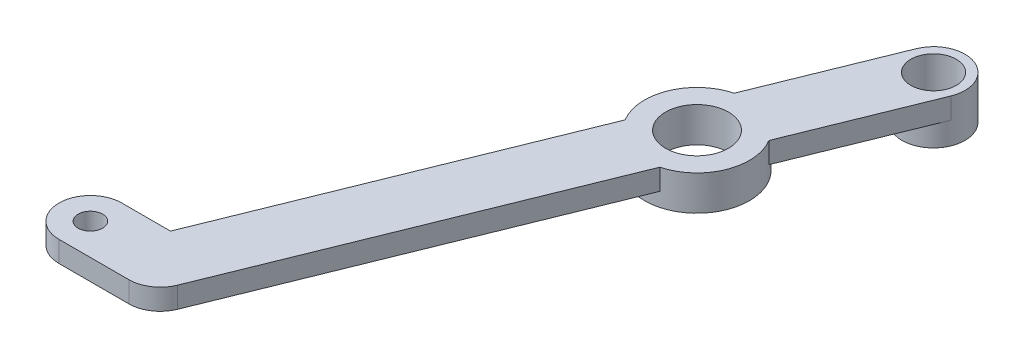
ISO-10303-21;
HEADER;
FILE_DESCRIPTION(('STEP AP214'),'2;1');
FILE_NAME('part.step','',(''),(''),'','','');
FILE_SCHEMA(('AUTOMOTIVE_DESIGN { 1 0 10303 214 1 1 1 1 }'));
ENDSEC;
DATA;
#1=APPLICATION_CONTEXT('core data for automotive mechanical design processes');
#2=APPLICATION_PROTOCOL_DEFINITION('international standard','automotive_design',2000,#1);
#3=PRODUCT_CONTEXT('',#1,'mechanical');
#4=PRODUCT('Part','Part','',(#3));
#5=PRODUCT_RELATED_PRODUCT_CATEGORY('part','',(#4));
#6=PRODUCT_DEFINITION_FORMATION('','',#4);
#7=PRODUCT_DEFINITION_CONTEXT('part definition',#1,'design');
#8=PRODUCT_DEFINITION('design','',#6,#7);
#9=PRODUCT_DEFINITION_SHAPE('','',#8);
#10=(LENGTH_UNIT() NAMED_UNIT(*) SI_UNIT(.MILLI.,.METRE.));
#11=(NAMED_UNIT(*) PLANE_ANGLE_UNIT() SI_UNIT($,.RADIAN.));
#12=(NAMED_UNIT(*) SI_UNIT($,.STERADIAN.) SOLID_ANGLE_UNIT());
#13=UNCERTAINTY_MEASURE_WITH_UNIT(LENGTH_MEASURE(1.E-05),#10,'distance_accuracy_value','');
#14=(GEOMETRIC_REPRESENTATION_CONTEXT(3) GLOBAL_UNCERTAINTY_ASSIGNED_CONTEXT((#13)) GLOBAL_UNIT_ASSIGNED_CONTEXT((#10,
#11,#12)) REPRESENTATION_CONTEXT('',''));
#15=CARTESIAN_POINT('',(0.,0.,0.));
#16=DIRECTION('',(0.,0.,1.));
#17=DIRECTION('',(1.,0.,0.));
#18=AXIS2_PLACEMENT_3D('',#15,#16,#17);
#19=CARTESIAN_POINT('',(0.,0.,0.));
#20=DIRECTION('',(0.,1.,0.));
#21=DIRECTION('',(0.,0.,1.));
#22=AXIS2_PLACEMENT_3D('',#19,#20,#21);
#23=PLANE('',#22);
#24=CARTESIAN_POINT('',(32.1376615678532,0.,-54.6893402804166));
#25=DIRECTION('',(0.,1.,0.));
#26=DIRECTION('',(0.,0.,1.));
#27=AXIS2_PLACEMENT_3D('',#24,#25,#26);
#28=CIRCLE('',#27,7.5);
#29=CARTESIAN_POINT('',(30.2177283160776,0.,-61.9394338183461));
#30=VERTEX_POINT('',#29);
#31=CARTESIAN_POINT('',(38.5601700537683,0.,-58.5625023927414));
#32=VERTEX_POINT('',#31);
#33=EDGE_CURVE('E240',#30,#32,#28,.F.);
#34=ORIENTED_EDGE('',*,*,#33,.F.);
#35=DIRECTION('',(-0.375214602844968,0.,0.926937970854519));
#36=VECTOR('',#35,1.);
#37=CARTESIAN_POINT('',(4.42091914927362,0.,1.78954091315865));
#38=LINE('',#37,#36);
#39=CARTESIAN_POINT('',(37.722020372977,0.,-80.4781932354364));
#40=VERTEX_POINT('',#39);
#41=EDGE_CURVE('E212',#40,#30,#38,.T.);
#42=ORIENTED_EDGE('',*,*,#41,.F.);
#43=CARTESIAN_POINT('',(41.8932412418223,0.,-78.7897275226341));
#44=DIRECTION('',(0.,1.,0.));
#45=DIRECTION('',(0.,0.,1.));
#46=AXIS2_PLACEMENT_3D('',#43,#44,#45);
#47=CIRCLE('',#46,4.49999999999999);
#48=CARTESIAN_POINT('',(46.0644621106677,0.,-77.1012618098318));
#49=VERTEX_POINT('',#48);
#50=EDGE_CURVE('E217',#40,#49,#47,.T.);
#51=ORIENTED_EDGE('',*,*,#50,.T.);
#52=DIRECTION('',(0.375214602844968,0.,-0.926937970854519));
#53=VECTOR('',#52,1.);
#54=CARTESIAN_POINT('',(12.7633608869643,0.,5.16647233876335));
#55=LINE('',#54,#53);
#56=EDGE_CURVE('E215',#32,#49,#55,.T.);
#57=ORIENTED_EDGE('',*,*,#56,.F.);
#58=EDGE_LOOP('',(#34,#42,#51,#57));
#59=FACE_BOUND('',#58,.T.);
#60=ADVANCED_FACE('F35',(#59),#23,.F.);
#61=CARTESIAN_POINT('',(4.42091914927362,0.,1.78954091315865));
#62=DIRECTION('',(-0.926937970854519,0.,-0.375214602844968));
#63=DIRECTION('',(-0.375214602844968,0.,0.926937970854519));
#64=AXIS2_PLACEMENT_3D('',#61,#62,#63);
#65=PLANE('',#64);
#66=DIRECTION('',(-0.375214602844968,0.,0.926937970854519));
#67=VECTOR('',#66,1.);
#68=CARTESIAN_POINT('',(4.42091914927362,3.,1.78954091315865));
#69=LINE('',#68,#67);
#70=CARTESIAN_POINT('',(25.715153081938,3.,-50.8161781680919));
#71=VERTEX_POINT('',#70);
#72=CARTESIAN_POINT('',(6.96685821964362,3.,-4.5));
#73=VERTEX_POINT('',#72);
#74=EDGE_CURVE('E57',#71,#73,#69,.T.);
#75=ORIENTED_EDGE('',*,*,#74,.F.);
#76=DIRECTION('',(0.,1.,0.));
#77=VECTOR('',#76,1.);
#78=CARTESIAN_POINT('',(25.715153081938,-2.,-50.8161781680918));
#79=LINE('',#78,#77);
#80=CARTESIAN_POINT('',(25.715153081938,0.,-50.8161781680918));
#81=VERTEX_POINT('',#80);
#82=EDGE_CURVE('E211',#71,#81,#79,.F.);
#83=ORIENTED_EDGE('',*,*,#82,.T.);
#84=CARTESIAN_POINT('',(6.96685821964362,0.,-4.5));
#85=VERTEX_POINT('',#84);
#86=EDGE_CURVE('E144',#81,#85,#38,.T.);
#87=ORIENTED_EDGE('',*,*,#86,.T.);
#88=DIRECTION('',(0.,1.,0.));
#89=VECTOR('',#88,1.);
#90=CARTESIAN_POINT('',(6.96685821964361,0.,-4.5));
#91=LINE('',#90,#89);
#92=EDGE_CURVE('E158',#85,#73,#91,.T.);
#93=ORIENTED_EDGE('',*,*,#92,.T.);
#94=EDGE_LOOP('',(#75,#83,#87,#93));
#95=FACE_BOUND('',#94,.T.);
#96=ADVANCED_FACE('F208',(#95),#65,.T.);
#97=ORIENTED_EDGE('',*,*,#41,.T.);
#98=DIRECTION('',(0.,1.,0.));
#99=VECTOR('',#98,1.);
#100=CARTESIAN_POINT('',(30.2177283160776,-2.,-61.9394338183461));
#101=LINE('',#100,#99);
#102=CARTESIAN_POINT('',(30.2177283160776,3.,-61.9394338183461));
#103=VERTEX_POINT('',#102);
#104=EDGE_CURVE('E238',#30,#103,#101,.T.);
#105=ORIENTED_EDGE('',*,*,#104,.T.);
#106=CARTESIAN_POINT('',(37.722020372977,3.,-80.4781932354364));
#107=VERTEX_POINT('',#106);
#108=EDGE_CURVE('E146',#107,#103,#69,.T.);
#109=ORIENTED_EDGE('',*,*,#108,.F.);
#110=DIRECTION('',(0.,1.,0.));
#111=VECTOR('',#110,1.);
#112=CARTESIAN_POINT('',(37.722020372977,0.,-80.4781932354364));
#113=LINE('',#112,#111);
#114=EDGE_CURVE('E150',#40,#107,#113,.T.);
#115=ORIENTED_EDGE('',*,*,#114,.F.);
#116=EDGE_LOOP('',(#97,#105,#109,#115));
#117=FACE_BOUND('',#116,.T.);
#118=ADVANCED_FACE('F237',(#117),#65,.T.);
#119=CARTESIAN_POINT('',(12.7633608869643,0.,5.16647233876335));
#120=DIRECTION('',(0.926937970854519,0.,0.375214602844969));
#121=DIRECTION('',(0.375214602844969,0.,-0.926937970854519));
#122=AXIS2_PLACEMENT_3D('',#119,#120,#121);
#123=PLANE('',#122);
#124=DIRECTION('',(0.375214602844968,0.,-0.926937970854519));
#125=VECTOR('',#124,1.);
#126=CARTESIAN_POINT('',(12.7633608869643,3.,5.16647233876335));
#127=LINE('',#126,#125);
#128=CARTESIAN_POINT('',(38.5601700537683,3.,-58.5625023927414));
#129=VERTEX_POINT('',#128);
#130=CARTESIAN_POINT('',(46.0644621106677,3.,-77.1012618098318));
#131=VERTEX_POINT('',#130);
#132=EDGE_CURVE('E141',#129,#131,#127,.T.);
#133=ORIENTED_EDGE('',*,*,#132,.F.);
#134=DIRECTION('',(0.,1.,0.));
#135=VECTOR('',#134,1.);
#136=CARTESIAN_POINT('',(38.5601700537683,-2.,-58.5625023927414));
#137=LINE('',#136,#135);
#138=EDGE_CURVE('E11',#129,#32,#137,.F.);
#139=ORIENTED_EDGE('',*,*,#138,.T.);
#140=ORIENTED_EDGE('',*,*,#56,.T.);
#141=DIRECTION('',(0.,1.,0.));
#142=VECTOR('',#141,1.);
#143=CARTESIAN_POINT('',(46.0644621106677,0.,-77.1012618098318));
#144=LINE('',#143,#142);
#145=EDGE_CURVE('E153',#49,#131,#144,.T.);
#146=ORIENTED_EDGE('',*,*,#145,.T.);
#147=EDGE_LOOP('',(#133,#139,#140,#146));
#148=FACE_BOUND('',#147,.T.);
#149=ADVANCED_FACE('F222',(#148),#123,.T.);
#150=CARTESIAN_POINT('',(14.1712208688453,0.,1.68846571280235));
#151=VERTEX_POINT('',#150);
#152=CARTESIAN_POINT('',(34.0575948196287,0.,-47.4392467424871));
#153=VERTEX_POINT('',#152);
#154=EDGE_CURVE('E132',#151,#153,#55,.T.);
#155=ORIENTED_EDGE('',*,*,#154,.T.);
#156=DIRECTION('',(0.,1.,0.));
#157=VECTOR('',#156,1.);
#158=CARTESIAN_POINT('',(34.0575948196287,-2.,-47.4392467424871));
#159=LINE('',#158,#157);
#160=CARTESIAN_POINT('',(34.0575948196287,3.,-47.4392467424871));
#161=VERTEX_POINT('',#160);
#162=EDGE_CURVE('E43',#153,#161,#159,.T.);
#163=ORIENTED_EDGE('',*,*,#162,.T.);
#164=CARTESIAN_POINT('',(14.1712208688453,3.,1.68846571280235));
#165=VERTEX_POINT('',#164);
#166=EDGE_CURVE('E130',#165,#161,#127,.T.);
#167=ORIENTED_EDGE('',*,*,#166,.F.);
#168=DIRECTION('',(0.,1.,0.));
#169=VECTOR('',#168,1.);
#170=CARTESIAN_POINT('',(14.1712208688453,0.,1.68846571280236));
#171=LINE('',#170,#169);
#172=EDGE_CURVE('E156',#151,#165,#171,.T.);
#173=ORIENTED_EDGE('',*,*,#172,.F.);
#174=EDGE_LOOP('',(#155,#163,#167,#173));
#175=FACE_BOUND('',#174,.T.);
#176=ADVANCED_FACE('F128',(#175),#123,.T.);
#177=CARTESIAN_POINT('',(0.,3.,0.));
#178=DIRECTION('',(0.,-1.,0.));
#179=DIRECTION('',(0.,0.,-1.));
#180=AXIS2_PLACEMENT_3D('',#177,#178,#179);
#181=CYLINDRICAL_SURFACE('',#180,4.5);
#182=CARTESIAN_POINT('',(0.,0.,0.));
#183=DIRECTION('',(0.,1.,0.));
#184=DIRECTION('',(0.,0.,1.));
#185=AXIS2_PLACEMENT_3D('',#182,#183,#184);
#186=CIRCLE('',#185,4.5);
#187=CARTESIAN_POINT('',(0.,0.,-4.5));
#188=VERTEX_POINT('',#187);
#189=CARTESIAN_POINT('',(0.,0.,4.5));
#190=VERTEX_POINT('',#189);
#191=EDGE_CURVE('E176',#188,#190,#186,.T.);
#192=ORIENTED_EDGE('',*,*,#191,.T.);
#193=DIRECTION('',(0.,-1.,0.));
#194=VECTOR('',#193,1.);
#195=CARTESIAN_POINT('',(0.,3.,4.5));
#196=LINE('',#195,#194);
#197=CARTESIAN_POINT('',(0.,3.,4.5));
#198=VERTEX_POINT('',#197);
#199=EDGE_CURVE('E133',#198,#190,#196,.T.);
#200=ORIENTED_EDGE('',*,*,#199,.F.);
#201=CARTESIAN_POINT('',(0.,3.,0.));
#202=DIRECTION('',(0.,1.,0.));
#203=DIRECTION('',(0.,0.,1.));
#204=AXIS2_PLACEMENT_3D('',#201,#202,#203);
#205=CIRCLE('',#204,4.5);
#206=CARTESIAN_POINT('',(0.,3.,-4.5));
#207=VERTEX_POINT('',#206);
#208=EDGE_CURVE('E164',#207,#198,#205,.T.);
#209=ORIENTED_EDGE('',*,*,#208,.F.);
#210=DIRECTION('',(0.,-1.,0.));
#211=VECTOR('',#210,1.);
#212=CARTESIAN_POINT('',(0.,3.,-4.5));
#213=LINE('',#212,#211);
#214=EDGE_CURVE('E173',#207,#188,#213,.T.);
#215=ORIENTED_EDGE('',*,*,#214,.T.);
#216=EDGE_LOOP('',(#192,#200,#209,#215));
#217=FACE_BOUND('',#216,.T.);
#218=ADVANCED_FACE('F196',(#217),#181,.T.);
#219=CARTESIAN_POINT('',(0.,3.,4.5));
#220=DIRECTION('',(0.,0.,1.));
#221=DIRECTION('',(1.,0.,0.));
#222=AXIS2_PLACEMENT_3D('',#219,#220,#221);
#223=PLANE('',#222);
#224=DIRECTION('',(-1.,0.,0.));
#225=VECTOR('',#224,1.);
#226=CARTESIAN_POINT('',(0.,0.,4.5));
#227=LINE('',#226,#225);
#228=CARTESIAN_POINT('',(10.,0.,4.5));
#229=VERTEX_POINT('',#228);
#230=EDGE_CURVE('E179',#229,#190,#227,.T.);
#231=ORIENTED_EDGE('',*,*,#230,.F.);
#232=DIRECTION('',(0.,-1.,0.));
#233=VECTOR('',#232,1.);
#234=CARTESIAN_POINT('',(10.,3.,4.5));
#235=LINE('',#234,#233);
#236=CARTESIAN_POINT('',(10.,3.,4.5));
#237=VERTEX_POINT('',#236);
#238=EDGE_CURVE('E187',#237,#229,#235,.T.);
#239=ORIENTED_EDGE('',*,*,#238,.F.);
#240=DIRECTION('',(-1.,0.,0.));
#241=VECTOR('',#240,1.);
#242=CARTESIAN_POINT('',(0.,3.,4.5));
#243=LINE('',#242,#241);
#244=EDGE_CURVE('E167',#237,#198,#243,.T.);
#245=ORIENTED_EDGE('',*,*,#244,.T.);
#246=ORIENTED_EDGE('',*,*,#199,.T.);
#247=EDGE_LOOP('',(#231,#239,#245,#246));
#248=FACE_BOUND('',#247,.T.);
#249=ADVANCED_FACE('F192',(#248),#223,.T.);
#250=CARTESIAN_POINT('',(10.,3.,0.));
#251=DIRECTION('',(0.,-1.,0.));
#252=DIRECTION('',(0.,0.,-1.));
#253=AXIS2_PLACEMENT_3D('',#250,#251,#252);
#254=CYLINDRICAL_SURFACE('',#253,4.50000000000001);
#255=CARTESIAN_POINT('',(10.,0.,0.));
#256=DIRECTION('',(0.,1.,0.));
#257=DIRECTION('',(0.,0.,1.));
#258=AXIS2_PLACEMENT_3D('',#255,#256,#257);
#259=CIRCLE('',#258,4.50000000000001);
#260=EDGE_CURVE('E182',#229,#151,#259,.T.);
#261=ORIENTED_EDGE('',*,*,#260,.T.);
#262=ORIENTED_EDGE('',*,*,#172,.T.);
#263=CARTESIAN_POINT('',(10.,3.,0.));
#264=DIRECTION('',(0.,1.,0.));
#265=DIRECTION('',(0.,0.,1.));
#266=AXIS2_PLACEMENT_3D('',#263,#264,#265);
#267=CIRCLE('',#266,4.50000000000001);
#268=EDGE_CURVE('E139',#237,#165,#267,.T.);
#269=ORIENTED_EDGE('',*,*,#268,.F.);
#270=ORIENTED_EDGE('',*,*,#238,.T.);
#271=EDGE_LOOP('',(#261,#262,#269,#270));
#272=FACE_BOUND('',#271,.T.);
#273=ADVANCED_FACE('F203',(#272),#254,.T.);
#274=CARTESIAN_POINT('',(0.,3.,0.));
#275=DIRECTION('',(0.,-1.,0.));
#276=DIRECTION('',(0.,0.,-1.));
#277=AXIS2_PLACEMENT_3D('',#274,#275,#276);
#278=CYLINDRICAL_SURFACE('',#277,1.75);
#279=CARTESIAN_POINT('',(0.,3.,0.));
#280=DIRECTION('',(0.,1.,0.));
#281=DIRECTION('',(0.,0.,1.));
#282=AXIS2_PLACEMENT_3D('',#279,#280,#281);
#283=CIRCLE('',#282,1.75);
#284=CARTESIAN_POINT('',(0.,3.,1.75));
#285=VERTEX_POINT('',#284);
#286=EDGE_CURVE('E161',#285,#285,#283,.T.);
#287=ORIENTED_EDGE('',*,*,#286,.T.);
#288=EDGE_LOOP('',(#287));
#289=FACE_BOUND('',#288,.T.);
#290=CARTESIAN_POINT('',(0.,0.,0.));
#291=DIRECTION('',(0.,1.,0.));
#292=DIRECTION('',(0.,0.,1.));
#293=AXIS2_PLACEMENT_3D('',#290,#291,#292);
#294=CIRCLE('',#293,1.75);
#295=CARTESIAN_POINT('',(0.,0.,1.75));
#296=VERTEX_POINT('',#295);
#297=EDGE_CURVE('E152',#296,#296,#294,.T.);
#298=ORIENTED_EDGE('',*,*,#297,.F.);
#299=EDGE_LOOP('',(#298));
#300=FACE_BOUND('',#299,.T.);
#301=ADVANCED_FACE('F37',(#289,#300),#278,.F.);
#302=CARTESIAN_POINT('',(0.,3.,-4.5));
#303=DIRECTION('',(0.,0.,-1.));
#304=DIRECTION('',(-1.,0.,0.));
#305=AXIS2_PLACEMENT_3D('',#302,#303,#304);
#306=PLANE('',#305);
#307=ORIENTED_EDGE('',*,*,#92,.F.);
#308=DIRECTION('',(1.,0.,0.));
#309=VECTOR('',#308,1.);
#310=CARTESIAN_POINT('',(0.,0.,-4.5));
#311=LINE('',#310,#309);
#312=EDGE_CURVE('E165',#188,#85,#311,.T.);
#313=ORIENTED_EDGE('',*,*,#312,.F.);
#314=ORIENTED_EDGE('',*,*,#214,.F.);
#315=DIRECTION('',(1.,0.,0.));
#316=VECTOR('',#315,1.);
#317=CARTESIAN_POINT('',(0.,3.,-4.5));
#318=LINE('',#317,#316);
#319=EDGE_CURVE('E171',#207,#73,#318,.T.);
#320=ORIENTED_EDGE('',*,*,#319,.T.);
#321=EDGE_LOOP('',(#307,#313,#314,#320));
#322=FACE_BOUND('',#321,.T.);
#323=ADVANCED_FACE('F206',(#322),#306,.T.);
#324=CARTESIAN_POINT('',(0.,3.,0.));
#325=DIRECTION('',(0.,1.,0.));
#326=DIRECTION('',(0.,0.,1.));
#327=AXIS2_PLACEMENT_3D('',#324,#325,#326);
#328=PLANE('',#327);
#329=CARTESIAN_POINT('',(32.1376615678532,3.,-54.6893402804166));
#330=DIRECTION('',(0.,-1.,0.));
#331=DIRECTION('',(0.,0.,-1.));
#332=AXIS2_PLACEMENT_3D('',#329,#330,#331);
#333=CIRCLE('',#332,4.5);
#334=CARTESIAN_POINT('',(32.1376615678532,3.,-59.1893402804166));
#335=VERTEX_POINT('',#334);
#336=EDGE_CURVE('E364',#335,#335,#333,.T.);
#337=ORIENTED_EDGE('',*,*,#336,.T.);
#338=EDGE_LOOP('',(#337));
#339=FACE_BOUND('',#338,.T.);
#340=ORIENTED_EDGE('',*,*,#166,.T.);
#341=CARTESIAN_POINT('',(32.1376615678532,3.,-54.6893402804166));
#342=DIRECTION('',(0.,-1.,0.));
#343=DIRECTION('',(0.,0.,-1.));
#344=AXIS2_PLACEMENT_3D('',#341,#342,#343);
#345=CIRCLE('',#344,7.5);
#346=EDGE_CURVE('E50',#129,#161,#345,.T.);
#347=ORIENTED_EDGE('',*,*,#346,.F.);
#348=ORIENTED_EDGE('',*,*,#132,.T.);
#349=CARTESIAN_POINT('',(41.8932412418223,3.,-78.7897275226341));
#350=DIRECTION('',(0.,1.,0.));
#351=DIRECTION('',(0.,0.,1.));
#352=AXIS2_PLACEMENT_3D('',#349,#350,#351);
#353=CIRCLE('',#352,4.50000000000001);
#354=EDGE_CURVE('E140',#131,#107,#353,.T.);
#355=ORIENTED_EDGE('',*,*,#354,.T.);
#356=ORIENTED_EDGE('',*,*,#108,.T.);
#357=EDGE_CURVE('E123',#71,#103,#345,.T.);
#358=ORIENTED_EDGE('',*,*,#357,.F.);
#359=ORIENTED_EDGE('',*,*,#74,.T.);
#360=ORIENTED_EDGE('',*,*,#319,.F.);
#361=ORIENTED_EDGE('',*,*,#208,.T.);
#362=ORIENTED_EDGE('',*,*,#244,.F.);
#363=ORIENTED_EDGE('',*,*,#268,.T.);
#364=EDGE_LOOP('',(#340,#347,#348,#355,#356,#358,#359,#360,#361,#362,#363));
#365=FACE_BOUND('',#364,.T.);
#366=ORIENTED_EDGE('',*,*,#286,.F.);
#367=EDGE_LOOP('',(#366));
#368=FACE_BOUND('',#367,.T.);
#369=CARTESIAN_POINT('',(41.8932412418223,3.,-78.7897275226341));
#370=DIRECTION('',(0.,1.,0.));
#371=DIRECTION('',(0.,0.,1.));
#372=AXIS2_PLACEMENT_3D('',#369,#370,#371);
#373=CIRCLE('',#372,3.25);
#374=CARTESIAN_POINT('',(41.8932412418223,3.,-75.5397275226341));
#375=VERTEX_POINT('',#374);
#376=EDGE_CURVE('E239',#375,#375,#373,.T.);
#377=ORIENTED_EDGE('',*,*,#376,.F.);
#378=EDGE_LOOP('',(#377));
#379=FACE_BOUND('',#378,.T.);
#380=ADVANCED_FACE('F135',(#339,#365,#368,#379),#328,.T.);
#381=EDGE_CURVE('E246',#153,#81,#28,.F.);
#382=ORIENTED_EDGE('',*,*,#381,.F.);
#383=ORIENTED_EDGE('',*,*,#154,.F.);
#384=ORIENTED_EDGE('',*,*,#260,.F.);
#385=ORIENTED_EDGE('',*,*,#230,.T.);
#386=ORIENTED_EDGE('',*,*,#191,.F.);
#387=ORIENTED_EDGE('',*,*,#312,.T.);
#388=ORIENTED_EDGE('',*,*,#86,.F.);
#389=EDGE_LOOP('',(#382,#383,#384,#385,#386,#387,#388));
#390=FACE_BOUND('',#389,.T.);
#391=ORIENTED_EDGE('',*,*,#297,.T.);
#392=EDGE_LOOP('',(#391));
#393=FACE_BOUND('',#392,.T.);
#394=ADVANCED_FACE('F200',(#390,#393),#23,.F.);
#395=CARTESIAN_POINT('',(41.8932412418223,0.,-78.7897275226341));
#396=DIRECTION('',(0.,1.,0.));
#397=DIRECTION('',(0.,0.,1.));
#398=AXIS2_PLACEMENT_3D('',#395,#396,#397);
#399=CYLINDRICAL_SURFACE('',#398,4.50000000000001);
#400=ORIENTED_EDGE('',*,*,#354,.F.);
#401=ORIENTED_EDGE('',*,*,#145,.F.);
#402=ORIENTED_EDGE('',*,*,#50,.F.);
#403=ORIENTED_EDGE('',*,*,#114,.T.);
#404=EDGE_LOOP('',(#400,#401,#402,#403));
#405=FACE_BOUND('',#404,.T.);
#406=CARTESIAN_POINT('',(41.8932412418223,-3.2,-78.7897275226341));
#407=DIRECTION('',(0.,1.,0.));
#408=DIRECTION('',(0.,0.,1.));
#409=AXIS2_PLACEMENT_3D('',#406,#407,#408);
#410=CIRCLE('',#409,4.49999999999999);
#411=CARTESIAN_POINT('',(41.8932412418223,-3.2,-74.2897275226341));
#412=VERTEX_POINT('',#411);
#413=EDGE_CURVE('E230',#412,#412,#410,.T.);
#414=ORIENTED_EDGE('',*,*,#413,.T.);
#415=EDGE_LOOP('',(#414));
#416=FACE_BOUND('',#415,.T.);
#417=ADVANCED_FACE('F231',(#405,#416),#399,.T.);
#418=CARTESIAN_POINT('',(41.8932412418223,-3.2,-78.7897275226341));
#419=DIRECTION('',(0.,1.,0.));
#420=DIRECTION('',(0.,0.,1.));
#421=AXIS2_PLACEMENT_3D('',#418,#419,#420);
#422=CYLINDRICAL_SURFACE('',#421,3.25);
#423=CARTESIAN_POINT('',(41.8932412418223,-3.2,-78.7897275226341));
#424=DIRECTION('',(0.,1.,0.));
#425=DIRECTION('',(0.,0.,1.));
#426=AXIS2_PLACEMENT_3D('',#423,#424,#425);
#427=CIRCLE('',#426,3.25);
#428=CARTESIAN_POINT('',(41.8932412418223,-3.2,-75.5397275226341));
#429=VERTEX_POINT('',#428);
#430=EDGE_CURVE('E243',#429,#429,#427,.T.);
#431=ORIENTED_EDGE('',*,*,#430,.F.);
#432=EDGE_LOOP('',(#431));
#433=FACE_BOUND('',#432,.T.);
#434=ORIENTED_EDGE('',*,*,#376,.T.);
#435=EDGE_LOOP('',(#434));
#436=FACE_BOUND('',#435,.T.);
#437=ADVANCED_FACE('F255',(#433,#436),#422,.F.);
#438=CARTESIAN_POINT('',(41.8932412418223,-3.2,-78.7897275226341));
#439=DIRECTION('',(0.,1.,0.));
#440=DIRECTION('',(0.,0.,1.));
#441=AXIS2_PLACEMENT_3D('',#438,#439,#440);
#442=PLANE('',#441);
#443=ORIENTED_EDGE('',*,*,#430,.T.);
#444=EDGE_LOOP('',(#443));
#445=FACE_BOUND('',#444,.T.);
#446=ORIENTED_EDGE('',*,*,#413,.F.);
#447=EDGE_LOOP('',(#446));
#448=FACE_BOUND('',#447,.T.);
#449=ADVANCED_FACE('F253',(#445,#448),#442,.F.);
#450=CARTESIAN_POINT('',(32.1376615678532,-2.,-54.6893402804166));
#451=DIRECTION('',(0.,1.,0.));
#452=DIRECTION('',(0.,0.,1.));
#453=AXIS2_PLACEMENT_3D('',#450,#451,#452);
#454=CYLINDRICAL_SURFACE('',#453,7.5);
#455=ORIENTED_EDGE('',*,*,#104,.F.);
#456=ORIENTED_EDGE('',*,*,#33,.T.);
#457=ORIENTED_EDGE('',*,*,#138,.F.);
#458=ORIENTED_EDGE('',*,*,#346,.T.);
#459=ORIENTED_EDGE('',*,*,#162,.F.);
#460=ORIENTED_EDGE('',*,*,#381,.T.);
#461=ORIENTED_EDGE('',*,*,#82,.F.);
#462=ORIENTED_EDGE('',*,*,#357,.T.);
#463=EDGE_LOOP('',(#455,#456,#457,#458,#459,#460,#461,#462));
#464=FACE_BOUND('',#463,.T.);
#465=CARTESIAN_POINT('',(32.1376615678532,-2.,-54.6893402804166));
#466=DIRECTION('',(0.,-1.,0.));
#467=DIRECTION('',(0.,0.,-1.));
#468=AXIS2_PLACEMENT_3D('',#465,#466,#467);
#469=CIRCLE('',#468,7.5);
#470=CARTESIAN_POINT('',(32.1376615678532,-2.,-62.1893402804166));
#471=VERTEX_POINT('',#470);
#472=EDGE_CURVE('E122',#471,#471,#469,.T.);
#473=ORIENTED_EDGE('',*,*,#472,.F.);
#474=EDGE_LOOP('',(#473));
#475=FACE_BOUND('',#474,.T.);
#476=ADVANCED_FACE('F118',(#464,#475),#454,.T.);
#477=CARTESIAN_POINT('',(32.1376615678532,-2.,-54.6893402804166));
#478=DIRECTION('',(0.,-1.,0.));
#479=DIRECTION('',(0.,0.,-1.));
#480=AXIS2_PLACEMENT_3D('',#477,#478,#479);
#481=PLANE('',#480);
#482=CARTESIAN_POINT('',(32.1376615678532,-2.,-54.6893402804166));
#483=DIRECTION('',(0.,-1.,0.));
#484=DIRECTION('',(0.,0.,-1.));
#485=AXIS2_PLACEMENT_3D('',#482,#483,#484);
#486=CIRCLE('',#485,4.5);
#487=CARTESIAN_POINT('',(32.1376615678532,-2.,-59.1893402804166));
#488=VERTEX_POINT('',#487);
#489=EDGE_CURVE('E367',#488,#488,#486,.T.);
#490=ORIENTED_EDGE('',*,*,#489,.F.);
#491=EDGE_LOOP('',(#490));
#492=FACE_BOUND('',#491,.T.);
#493=ORIENTED_EDGE('',*,*,#472,.T.);
#494=EDGE_LOOP('',(#493));
#495=FACE_BOUND('',#494,.T.);
#496=ADVANCED_FACE('F262',(#492,#495),#481,.T.);
#497=CARTESIAN_POINT('',(32.1376615678532,3.,-54.6893402804166));
#498=DIRECTION('',(0.,-1.,0.));
#499=DIRECTION('',(0.,0.,-1.));
#500=AXIS2_PLACEMENT_3D('',#497,#498,#499);
#501=CYLINDRICAL_SURFACE('',#500,4.5);
#502=ORIENTED_EDGE('',*,*,#336,.F.);
#503=EDGE_LOOP('',(#502));
#504=FACE_BOUND('',#503,.T.);
#505=ORIENTED_EDGE('',*,*,#489,.T.);
#506=EDGE_LOOP('',(#505));
#507=FACE_BOUND('',#506,.T.);
#508=ADVANCED_FACE('F348',(#504,#507),#501,.F.);
#509=CLOSED_SHELL('',(#60,#96,#118,#149,#176,#218,#249,#273,#301,#323,#380,#394,#417,#437,#449,
#476,#496,#508));
#510=MANIFOLD_SOLID_BREP('B2',#509);
#511=ADVANCED_BREP_SHAPE_REPRESENTATION('',(#18,#510),#14);
#512=SHAPE_DEFINITION_REPRESENTATION(#9,#511);
ENDSEC;
END-ISO-10303-21;
